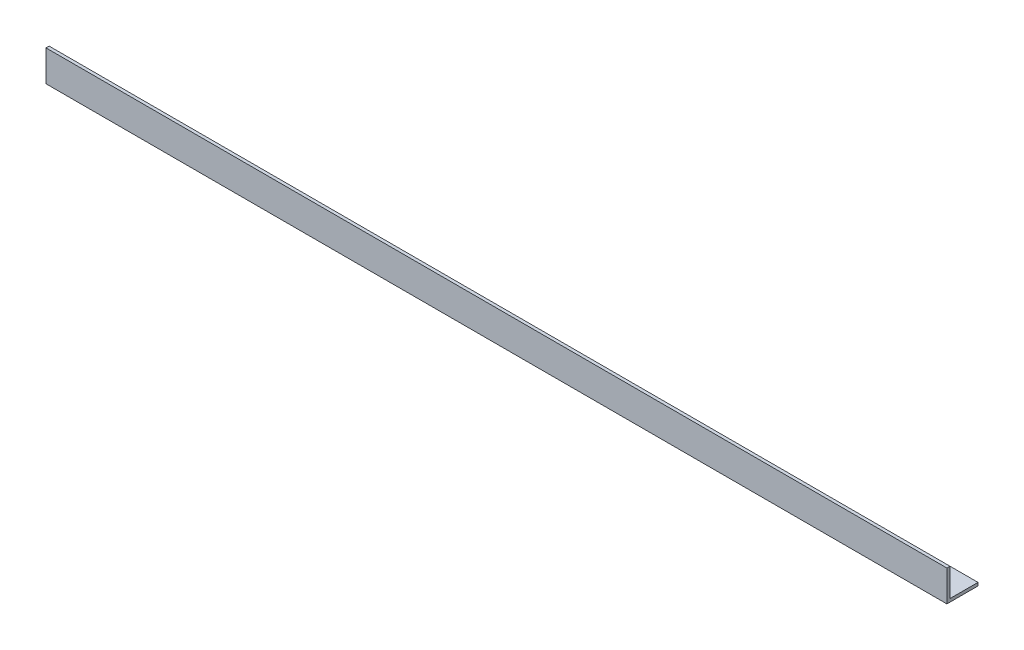
ISO-10303-21;
HEADER;
FILE_DESCRIPTION(('STEP AP214'),'2;1');
FILE_NAME('part.step','',(''),(''),'','','');
FILE_SCHEMA(('AUTOMOTIVE_DESIGN { 1 0 10303 214 1 1 1 1 }'));
ENDSEC;
DATA;
#1=APPLICATION_CONTEXT('core data for automotive mechanical design processes');
#2=APPLICATION_PROTOCOL_DEFINITION('international standard','automotive_design',2000,#1);
#3=PRODUCT_CONTEXT('',#1,'mechanical');
#4=PRODUCT('Part','Part','',(#3));
#5=PRODUCT_RELATED_PRODUCT_CATEGORY('part','',(#4));
#6=PRODUCT_DEFINITION_FORMATION('','',#4);
#7=PRODUCT_DEFINITION_CONTEXT('part definition',#1,'design');
#8=PRODUCT_DEFINITION('design','',#6,#7);
#9=PRODUCT_DEFINITION_SHAPE('','',#8);
#10=(LENGTH_UNIT() NAMED_UNIT(*) SI_UNIT(.MILLI.,.METRE.));
#11=(NAMED_UNIT(*) PLANE_ANGLE_UNIT() SI_UNIT($,.RADIAN.));
#12=(NAMED_UNIT(*) SI_UNIT($,.STERADIAN.) SOLID_ANGLE_UNIT());
#13=UNCERTAINTY_MEASURE_WITH_UNIT(LENGTH_MEASURE(1.E-05),#10,'distance_accuracy_value','');
#14=(GEOMETRIC_REPRESENTATION_CONTEXT(3) GLOBAL_UNCERTAINTY_ASSIGNED_CONTEXT((#13)) GLOBAL_UNIT_ASSIGNED_CONTEXT((#10,
#11,#12)) REPRESENTATION_CONTEXT('',''));
#15=CARTESIAN_POINT('',(0.,0.,0.));
#16=DIRECTION('',(0.,0.,1.));
#17=DIRECTION('',(1.,0.,0.));
#18=AXIS2_PLACEMENT_3D('',#15,#16,#17);
#19=CARTESIAN_POINT('',(434.5,0.,-15.));
#20=DIRECTION('',(0.,1.,0.));
#21=DIRECTION('',(0.,0.,1.));
#22=AXIS2_PLACEMENT_3D('',#19,#20,#21);
#23=PLANE('',#22);
#24=DIRECTION('',(0.,0.,-1.));
#25=VECTOR('',#24,1.);
#26=CARTESIAN_POINT('',(0.,0.,-15.));
#27=LINE('',#26,#25);
#28=CARTESIAN_POINT('',(0.,0.,0.));
#29=VERTEX_POINT('',#28);
#30=CARTESIAN_POINT('',(0.,0.,-15.));
#31=VERTEX_POINT('',#30);
#32=EDGE_CURVE('E119',#29,#31,#27,.T.);
#33=ORIENTED_EDGE('',*,*,#32,.T.);
#34=DIRECTION('',(-1.,0.,0.));
#35=VECTOR('',#34,1.);
#36=CARTESIAN_POINT('',(434.5,0.,-15.));
#37=LINE('',#36,#35);
#38=CARTESIAN_POINT('',(434.5,0.,-15.));
#39=VERTEX_POINT('',#38);
#40=EDGE_CURVE('E11',#39,#31,#37,.T.);
#41=ORIENTED_EDGE('',*,*,#40,.F.);
#42=DIRECTION('',(0.,0.,-1.));
#43=VECTOR('',#42,1.);
#44=CARTESIAN_POINT('',(434.5,0.,-15.));
#45=LINE('',#44,#43);
#46=CARTESIAN_POINT('',(434.5,0.,0.));
#47=VERTEX_POINT('',#46);
#48=EDGE_CURVE('E129',#47,#39,#45,.T.);
#49=ORIENTED_EDGE('',*,*,#48,.F.);
#50=DIRECTION('',(-1.,0.,0.));
#51=VECTOR('',#50,1.);
#52=CARTESIAN_POINT('',(434.5,0.,0.));
#53=LINE('',#52,#51);
#54=EDGE_CURVE('E115',#47,#29,#53,.T.);
#55=ORIENTED_EDGE('',*,*,#54,.T.);
#56=EDGE_LOOP('',(#33,#41,#49,#55));
#57=FACE_BOUND('',#56,.T.);
#58=ADVANCED_FACE('F35',(#57),#23,.F.);
#59=CARTESIAN_POINT('',(434.5,1.49999999999998,-15.));
#60=DIRECTION('',(0.,0.,1.));
#61=DIRECTION('',(1.,0.,0.));
#62=AXIS2_PLACEMENT_3D('',#59,#60,#61);
#63=PLANE('',#62);
#64=DIRECTION('',(0.,1.,0.));
#65=VECTOR('',#64,1.);
#66=CARTESIAN_POINT('',(0.,1.49999999999998,-15.));
#67=LINE('',#66,#65);
#68=CARTESIAN_POINT('',(0.,1.49999999999998,-15.));
#69=VERTEX_POINT('',#68);
#70=EDGE_CURVE('E122',#31,#69,#67,.T.);
#71=ORIENTED_EDGE('',*,*,#70,.T.);
#72=DIRECTION('',(-1.,0.,0.));
#73=VECTOR('',#72,1.);
#74=CARTESIAN_POINT('',(434.5,1.49999999999998,-15.));
#75=LINE('',#74,#73);
#76=CARTESIAN_POINT('',(434.5,1.49999999999998,-15.));
#77=VERTEX_POINT('',#76);
#78=EDGE_CURVE('E43',#77,#69,#75,.T.);
#79=ORIENTED_EDGE('',*,*,#78,.F.);
#80=DIRECTION('',(0.,1.,0.));
#81=VECTOR('',#80,1.);
#82=CARTESIAN_POINT('',(434.5,1.49999999999998,-15.));
#83=LINE('',#82,#81);
#84=EDGE_CURVE('E88',#39,#77,#83,.T.);
#85=ORIENTED_EDGE('',*,*,#84,.F.);
#86=ORIENTED_EDGE('',*,*,#40,.T.);
#87=EDGE_LOOP('',(#71,#79,#85,#86));
#88=FACE_BOUND('',#87,.T.);
#89=ADVANCED_FACE('F153',(#88),#63,.F.);
#90=CARTESIAN_POINT('',(434.5,1.5,-1.50000000000002));
#91=DIRECTION('',(0.,-1.,0.));
#92=DIRECTION('',(0.,0.,-1.));
#93=AXIS2_PLACEMENT_3D('',#90,#91,#92);
#94=PLANE('',#93);
#95=DIRECTION('',(0.,0.,1.));
#96=VECTOR('',#95,1.);
#97=CARTESIAN_POINT('',(0.,1.5,-1.50000000000002));
#98=LINE('',#97,#96);
#99=CARTESIAN_POINT('',(0.,1.5,-1.50000000000002));
#100=VERTEX_POINT('',#99);
#101=EDGE_CURVE('E124',#69,#100,#98,.T.);
#102=ORIENTED_EDGE('',*,*,#101,.T.);
#103=DIRECTION('',(-1.,0.,0.));
#104=VECTOR('',#103,1.);
#105=CARTESIAN_POINT('',(434.5,1.5,-1.50000000000002));
#106=LINE('',#105,#104);
#107=CARTESIAN_POINT('',(434.5,1.5,-1.50000000000002));
#108=VERTEX_POINT('',#107);
#109=EDGE_CURVE('E110',#108,#100,#106,.T.);
#110=ORIENTED_EDGE('',*,*,#109,.F.);
#111=DIRECTION('',(0.,0.,1.));
#112=VECTOR('',#111,1.);
#113=CARTESIAN_POINT('',(434.5,1.5,-1.50000000000002));
#114=LINE('',#113,#112);
#115=EDGE_CURVE('E101',#77,#108,#114,.T.);
#116=ORIENTED_EDGE('',*,*,#115,.F.);
#117=ORIENTED_EDGE('',*,*,#78,.T.);
#118=EDGE_LOOP('',(#102,#110,#116,#117));
#119=FACE_BOUND('',#118,.T.);
#120=ADVANCED_FACE('F135',(#119),#94,.F.);
#121=CARTESIAN_POINT('',(434.5,15.,-1.5));
#122=DIRECTION('',(0.,0.,1.));
#123=DIRECTION('',(0.,-1.,0.));
#124=AXIS2_PLACEMENT_3D('',#121,#122,#123);
#125=PLANE('',#124);
#126=DIRECTION('',(0.,1.,0.));
#127=VECTOR('',#126,1.);
#128=CARTESIAN_POINT('',(0.,15.,-1.5));
#129=LINE('',#128,#127);
#130=CARTESIAN_POINT('',(0.,15.,-1.5));
#131=VERTEX_POINT('',#130);
#132=EDGE_CURVE('E109',#100,#131,#129,.T.);
#133=ORIENTED_EDGE('',*,*,#132,.T.);
#134=DIRECTION('',(-1.,0.,0.));
#135=VECTOR('',#134,1.);
#136=CARTESIAN_POINT('',(434.5,15.,-1.5));
#137=LINE('',#136,#135);
#138=CARTESIAN_POINT('',(434.5,15.,-1.5));
#139=VERTEX_POINT('',#138);
#140=EDGE_CURVE('E106',#139,#131,#137,.T.);
#141=ORIENTED_EDGE('',*,*,#140,.F.);
#142=DIRECTION('',(0.,1.,0.));
#143=VECTOR('',#142,1.);
#144=CARTESIAN_POINT('',(434.5,15.,-1.5));
#145=LINE('',#144,#143);
#146=EDGE_CURVE('E95',#108,#139,#145,.T.);
#147=ORIENTED_EDGE('',*,*,#146,.F.);
#148=ORIENTED_EDGE('',*,*,#109,.T.);
#149=EDGE_LOOP('',(#133,#141,#147,#148));
#150=FACE_BOUND('',#149,.T.);
#151=ADVANCED_FACE('F107',(#150),#125,.F.);
#152=CARTESIAN_POINT('',(434.5,15.,0.));
#153=DIRECTION('',(0.,-1.,0.));
#154=DIRECTION('',(0.,0.,-1.));
#155=AXIS2_PLACEMENT_3D('',#152,#153,#154);
#156=PLANE('',#155);
#157=DIRECTION('',(0.,0.,1.));
#158=VECTOR('',#157,1.);
#159=CARTESIAN_POINT('',(0.,15.,0.));
#160=LINE('',#159,#158);
#161=CARTESIAN_POINT('',(0.,15.,0.));
#162=VERTEX_POINT('',#161);
#163=EDGE_CURVE('E74',#131,#162,#160,.T.);
#164=ORIENTED_EDGE('',*,*,#163,.T.);
#165=DIRECTION('',(-1.,0.,0.));
#166=VECTOR('',#165,1.);
#167=CARTESIAN_POINT('',(434.5,15.,0.));
#168=LINE('',#167,#166);
#169=CARTESIAN_POINT('',(434.5,15.,0.));
#170=VERTEX_POINT('',#169);
#171=EDGE_CURVE('E111',#170,#162,#168,.T.);
#172=ORIENTED_EDGE('',*,*,#171,.F.);
#173=DIRECTION('',(0.,0.,1.));
#174=VECTOR('',#173,1.);
#175=CARTESIAN_POINT('',(434.5,15.,0.));
#176=LINE('',#175,#174);
#177=EDGE_CURVE('E99',#139,#170,#176,.T.);
#178=ORIENTED_EDGE('',*,*,#177,.F.);
#179=ORIENTED_EDGE('',*,*,#140,.T.);
#180=EDGE_LOOP('',(#164,#172,#178,#179));
#181=FACE_BOUND('',#180,.T.);
#182=ADVANCED_FACE('F113',(#181),#156,.F.);
#183=CARTESIAN_POINT('',(434.5,0.,0.));
#184=DIRECTION('',(0.,0.,-1.));
#185=DIRECTION('',(-1.,0.,0.));
#186=AXIS2_PLACEMENT_3D('',#183,#184,#185);
#187=PLANE('',#186);
#188=DIRECTION('',(0.,-1.,0.));
#189=VECTOR('',#188,1.);
#190=CARTESIAN_POINT('',(0.,0.,0.));
#191=LINE('',#190,#189);
#192=EDGE_CURVE('E80',#162,#29,#191,.T.);
#193=ORIENTED_EDGE('',*,*,#192,.T.);
#194=ORIENTED_EDGE('',*,*,#54,.F.);
#195=DIRECTION('',(0.,-1.,0.));
#196=VECTOR('',#195,1.);
#197=CARTESIAN_POINT('',(434.5,0.,0.));
#198=LINE('',#197,#196);
#199=EDGE_CURVE('E51',#170,#47,#198,.T.);
#200=ORIENTED_EDGE('',*,*,#199,.F.);
#201=ORIENTED_EDGE('',*,*,#171,.T.);
#202=EDGE_LOOP('',(#193,#194,#200,#201));
#203=FACE_BOUND('',#202,.T.);
#204=ADVANCED_FACE('F142',(#203),#187,.F.);
#205=CARTESIAN_POINT('',(434.5,0.,0.));
#206=DIRECTION('',(-1.,0.,0.));
#207=DIRECTION('',(0.,0.,1.));
#208=AXIS2_PLACEMENT_3D('',#205,#206,#207);
#209=PLANE('',#208);
#210=ORIENTED_EDGE('',*,*,#48,.T.);
#211=ORIENTED_EDGE('',*,*,#84,.T.);
#212=ORIENTED_EDGE('',*,*,#115,.T.);
#213=ORIENTED_EDGE('',*,*,#146,.T.);
#214=ORIENTED_EDGE('',*,*,#177,.T.);
#215=ORIENTED_EDGE('',*,*,#199,.T.);
#216=EDGE_LOOP('',(#210,#211,#212,#213,#214,#215));
#217=FACE_BOUND('',#216,.T.);
#218=ADVANCED_FACE('F97',(#217),#209,.F.);
#219=CARTESIAN_POINT('',(0.,0.,0.));
#220=DIRECTION('',(-1.,0.,0.));
#221=DIRECTION('',(0.,0.,1.));
#222=AXIS2_PLACEMENT_3D('',#219,#220,#221);
#223=PLANE('',#222);
#224=ORIENTED_EDGE('',*,*,#32,.F.);
#225=ORIENTED_EDGE('',*,*,#192,.F.);
#226=ORIENTED_EDGE('',*,*,#163,.F.);
#227=ORIENTED_EDGE('',*,*,#132,.F.);
#228=ORIENTED_EDGE('',*,*,#101,.F.);
#229=ORIENTED_EDGE('',*,*,#70,.F.);
#230=EDGE_LOOP('',(#224,#225,#226,#227,#228,#229));
#231=FACE_BOUND('',#230,.T.);
#232=ADVANCED_FACE('F138',(#231),#223,.T.);
#233=CLOSED_SHELL('',(#58,#89,#120,#151,#182,#204,#218,#232));
#234=MANIFOLD_SOLID_BREP('B2',#233);
#235=ADVANCED_BREP_SHAPE_REPRESENTATION('',(#18,#234),#14);
#236=SHAPE_DEFINITION_REPRESENTATION(#9,#235);
ENDSEC;
END-ISO-10303-21;
